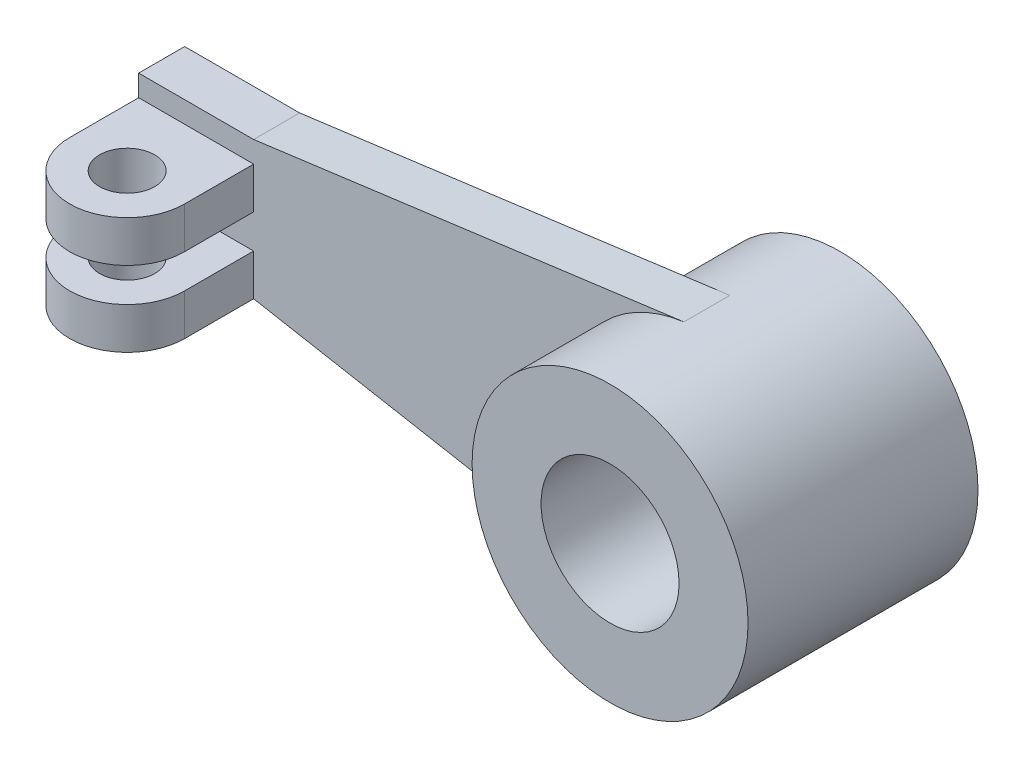
ISO-10303-21;
HEADER;
FILE_DESCRIPTION(('STEP AP214'),'2;1');
FILE_NAME('part.step','',(''),(''),'','','');
FILE_SCHEMA(('AUTOMOTIVE_DESIGN { 1 0 10303 214 1 1 1 1 }'));
ENDSEC;
DATA;
#1=APPLICATION_CONTEXT('core data for automotive mechanical design processes');
#2=APPLICATION_PROTOCOL_DEFINITION('international standard','automotive_design',2000,#1);
#3=PRODUCT_CONTEXT('',#1,'mechanical');
#4=PRODUCT('Part','Part','',(#3));
#5=PRODUCT_RELATED_PRODUCT_CATEGORY('part','',(#4));
#6=PRODUCT_DEFINITION_FORMATION('','',#4);
#7=PRODUCT_DEFINITION_CONTEXT('part definition',#1,'design');
#8=PRODUCT_DEFINITION('design','',#6,#7);
#9=PRODUCT_DEFINITION_SHAPE('','',#8);
#10=(LENGTH_UNIT() NAMED_UNIT(*) SI_UNIT(.MILLI.,.METRE.));
#11=(NAMED_UNIT(*) PLANE_ANGLE_UNIT() SI_UNIT($,.RADIAN.));
#12=(NAMED_UNIT(*) SI_UNIT($,.STERADIAN.) SOLID_ANGLE_UNIT());
#13=UNCERTAINTY_MEASURE_WITH_UNIT(LENGTH_MEASURE(1.E-05),#10,'distance_accuracy_value','');
#14=(GEOMETRIC_REPRESENTATION_CONTEXT(3) GLOBAL_UNCERTAINTY_ASSIGNED_CONTEXT((#13)) GLOBAL_UNIT_ASSIGNED_CONTEXT((#10,
#11,#12)) REPRESENTATION_CONTEXT('',''));
#15=CARTESIAN_POINT('',(0.,0.,0.));
#16=DIRECTION('',(0.,0.,1.));
#17=DIRECTION('',(1.,0.,0.));
#18=AXIS2_PLACEMENT_3D('',#15,#16,#17);
#19=CARTESIAN_POINT('',(0.,0.,25.));
#20=DIRECTION('',(0.,0.,1.));
#21=DIRECTION('',(1.,0.,0.));
#22=AXIS2_PLACEMENT_3D('',#19,#20,#21);
#23=PLANE('',#22);
#24=CARTESIAN_POINT('',(0.,0.,25.));
#25=DIRECTION('',(0.,0.,1.));
#26=DIRECTION('',(1.,0.,0.));
#27=AXIS2_PLACEMENT_3D('',#24,#25,#26);
#28=CIRCLE('',#27,30.);
#29=CARTESIAN_POINT('',(30.,0.,25.));
#30=VERTEX_POINT('',#29);
#31=EDGE_CURVE('E11',#30,#30,#28,.T.);
#32=ORIENTED_EDGE('',*,*,#31,.T.);
#33=EDGE_LOOP('',(#32));
#34=FACE_BOUND('',#33,.T.);
#35=CARTESIAN_POINT('',(0.,0.,25.));
#36=DIRECTION('',(0.,0.,1.));
#37=DIRECTION('',(1.,0.,0.));
#38=AXIS2_PLACEMENT_3D('',#35,#36,#37);
#39=CIRCLE('',#38,15.);
#40=CARTESIAN_POINT('',(15.,0.,25.));
#41=VERTEX_POINT('',#40);
#42=EDGE_CURVE('E241',#41,#41,#39,.T.);
#43=ORIENTED_EDGE('',*,*,#42,.F.);
#44=EDGE_LOOP('',(#43));
#45=FACE_BOUND('',#44,.T.);
#46=ADVANCED_FACE('F33',(#34,#45),#23,.T.);
#47=CARTESIAN_POINT('',(0.,0.,-25.));
#48=DIRECTION('',(0.,0.,1.));
#49=DIRECTION('',(1.,0.,0.));
#50=AXIS2_PLACEMENT_3D('',#47,#48,#49);
#51=PLANE('',#50);
#52=CARTESIAN_POINT('',(0.,0.,-25.));
#53=DIRECTION('',(0.,0.,1.));
#54=DIRECTION('',(1.,0.,0.));
#55=AXIS2_PLACEMENT_3D('',#52,#53,#54);
#56=CIRCLE('',#55,30.);
#57=CARTESIAN_POINT('',(30.,0.,-25.));
#58=VERTEX_POINT('',#57);
#59=EDGE_CURVE('E37',#58,#58,#56,.T.);
#60=ORIENTED_EDGE('',*,*,#59,.F.);
#61=EDGE_LOOP('',(#60));
#62=FACE_BOUND('',#61,.T.);
#63=CARTESIAN_POINT('',(0.,0.,-25.));
#64=DIRECTION('',(0.,0.,1.));
#65=DIRECTION('',(1.,0.,0.));
#66=AXIS2_PLACEMENT_3D('',#63,#64,#65);
#67=CIRCLE('',#66,15.);
#68=CARTESIAN_POINT('',(15.,0.,-25.));
#69=VERTEX_POINT('',#68);
#70=EDGE_CURVE('E240',#69,#69,#67,.T.);
#71=ORIENTED_EDGE('',*,*,#70,.T.);
#72=EDGE_LOOP('',(#71));
#73=FACE_BOUND('',#72,.T.);
#74=ADVANCED_FACE('F247',(#62,#73),#51,.F.);
#75=CARTESIAN_POINT('',(0.,0.,25.));
#76=DIRECTION('',(0.,0.,-1.));
#77=DIRECTION('',(-1.,0.,0.));
#78=AXIS2_PLACEMENT_3D('',#75,#76,#77);
#79=CYLINDRICAL_SURFACE('',#78,30.);
#80=DIRECTION('',(0.,0.,-1.));
#81=VECTOR('',#80,1.);
#82=CARTESIAN_POINT('',(-3.94864469314788,29.7390014137542,5.));
#83=LINE('',#82,#81);
#84=CARTESIAN_POINT('',(-3.94864469314787,29.7390014137542,5.));
#85=VERTEX_POINT('',#84);
#86=CARTESIAN_POINT('',(-3.94864469314788,29.7390014137542,-5.));
#87=VERTEX_POINT('',#86);
#88=EDGE_CURVE('E237',#85,#87,#83,.T.);
#89=ORIENTED_EDGE('',*,*,#88,.F.);
#90=CARTESIAN_POINT('',(0.,0.,5.));
#91=DIRECTION('',(0.,0.,-1.));
#92=DIRECTION('',(1.,0.,0.));
#93=AXIS2_PLACEMENT_3D('',#90,#91,#92);
#94=CIRCLE('',#93,30.);
#95=CARTESIAN_POINT('',(-5.39203009891174,-29.5114555963007,5.));
#96=VERTEX_POINT('',#95);
#97=EDGE_CURVE('E198',#96,#85,#94,.T.);
#98=ORIENTED_EDGE('',*,*,#97,.F.);
#99=DIRECTION('',(0.,0.,-1.));
#100=VECTOR('',#99,1.);
#101=CARTESIAN_POINT('',(-5.39203009891174,-29.5114555963007,5.));
#102=LINE('',#101,#100);
#103=CARTESIAN_POINT('',(-5.39203009891174,-29.5114555963007,-5.));
#104=VERTEX_POINT('',#103);
#105=EDGE_CURVE('E212',#96,#104,#102,.T.);
#106=ORIENTED_EDGE('',*,*,#105,.T.);
#107=CARTESIAN_POINT('',(0.,0.,-5.));
#108=DIRECTION('',(0.,0.,-1.));
#109=DIRECTION('',(1.,0.,0.));
#110=AXIS2_PLACEMENT_3D('',#107,#108,#109);
#111=CIRCLE('',#110,30.);
#112=EDGE_CURVE('E194',#104,#87,#111,.T.);
#113=ORIENTED_EDGE('',*,*,#112,.T.);
#114=EDGE_LOOP('',(#89,#98,#106,#113));
#115=FACE_BOUND('',#114,.T.);
#116=ORIENTED_EDGE('',*,*,#31,.F.);
#117=EDGE_LOOP('',(#116));
#118=FACE_BOUND('',#117,.T.);
#119=ORIENTED_EDGE('',*,*,#59,.T.);
#120=EDGE_LOOP('',(#119));
#121=FACE_BOUND('',#120,.T.);
#122=ADVANCED_FACE('F35',(#115,#118,#121),#79,.T.);
#123=CARTESIAN_POINT('',(0.,0.,25.));
#124=DIRECTION('',(0.,0.,-1.));
#125=DIRECTION('',(-1.,0.,0.));
#126=AXIS2_PLACEMENT_3D('',#123,#124,#125);
#127=CYLINDRICAL_SURFACE('',#126,15.);
#128=ORIENTED_EDGE('',*,*,#42,.T.);
#129=EDGE_LOOP('',(#128));
#130=FACE_BOUND('',#129,.T.);
#131=ORIENTED_EDGE('',*,*,#70,.F.);
#132=EDGE_LOOP('',(#131));
#133=FACE_BOUND('',#132,.T.);
#134=ADVANCED_FACE('F249',(#130,#133),#127,.F.);
#135=CARTESIAN_POINT('',(-3.94864469314788,29.7390014137542,5.));
#136=DIRECTION('',(0.131621489771596,-0.99130004712514,0.));
#137=DIRECTION('',(0.991300047125141,0.131621489771596,0.));
#138=AXIS2_PLACEMENT_3D('',#135,#136,#137);
#139=PLANE('',#138);
#140=DIRECTION('',(-0.991300047125141,-0.131621489771596,0.));
#141=VECTOR('',#140,1.);
#142=CARTESIAN_POINT('',(-3.94864469314788,29.7390014137542,-5.));
#143=LINE('',#142,#141);
#144=CARTESIAN_POINT('',(-97.5,17.3175667620061,-5.));
#145=VERTEX_POINT('',#144);
#146=EDGE_CURVE('E214',#87,#145,#143,.T.);
#147=ORIENTED_EDGE('',*,*,#146,.T.);
#148=DIRECTION('',(0.,0.,-1.));
#149=VECTOR('',#148,1.);
#150=CARTESIAN_POINT('',(-97.5,17.3175667620061,5.));
#151=LINE('',#150,#149);
#152=CARTESIAN_POINT('',(-97.5,17.3175667620061,5.));
#153=VERTEX_POINT('',#152);
#154=EDGE_CURVE('E234',#153,#145,#151,.T.);
#155=ORIENTED_EDGE('',*,*,#154,.F.);
#156=DIRECTION('',(-0.991300047125141,-0.131621489771596,0.));
#157=VECTOR('',#156,1.);
#158=CARTESIAN_POINT('',(-3.94864469314788,29.7390014137542,5.));
#159=LINE('',#158,#157);
#160=EDGE_CURVE('E201',#85,#153,#159,.T.);
#161=ORIENTED_EDGE('',*,*,#160,.F.);
#162=ORIENTED_EDGE('',*,*,#88,.T.);
#163=EDGE_LOOP('',(#147,#155,#161,#162));
#164=FACE_BOUND('',#163,.T.);
#165=ADVANCED_FACE('F251',(#164),#139,.F.);
#166=CARTESIAN_POINT('',(-97.5,17.3175667620061,5.));
#167=DIRECTION('',(0.,-1.,0.));
#168=DIRECTION('',(0.,0.,-1.));
#169=AXIS2_PLACEMENT_3D('',#166,#167,#168);
#170=PLANE('',#169);
#171=DIRECTION('',(-1.,0.,0.));
#172=VECTOR('',#171,1.);
#173=CARTESIAN_POINT('',(-97.5,17.3175667620061,-5.));
#174=LINE('',#173,#172);
#175=CARTESIAN_POINT('',(-122.5,17.3175667620061,-5.));
#176=VERTEX_POINT('',#175);
#177=EDGE_CURVE('E216',#145,#176,#174,.T.);
#178=ORIENTED_EDGE('',*,*,#177,.T.);
#179=DIRECTION('',(0.,0.,-1.));
#180=VECTOR('',#179,1.);
#181=CARTESIAN_POINT('',(-122.5,17.3175667620061,5.));
#182=LINE('',#181,#180);
#183=CARTESIAN_POINT('',(-122.5,17.3175667620061,5.));
#184=VERTEX_POINT('',#183);
#185=EDGE_CURVE('E231',#184,#176,#182,.T.);
#186=ORIENTED_EDGE('',*,*,#185,.F.);
#187=DIRECTION('',(-1.,0.,0.));
#188=VECTOR('',#187,1.);
#189=CARTESIAN_POINT('',(-97.5,17.3175667620061,5.));
#190=LINE('',#189,#188);
#191=EDGE_CURVE('E204',#153,#184,#190,.T.);
#192=ORIENTED_EDGE('',*,*,#191,.F.);
#193=ORIENTED_EDGE('',*,*,#154,.T.);
#194=EDGE_LOOP('',(#178,#186,#192,#193));
#195=FACE_BOUND('',#194,.T.);
#196=ADVANCED_FACE('F258',(#195),#170,.F.);
#197=CARTESIAN_POINT('',(-122.5,17.3175667620061,5.));
#198=DIRECTION('',(1.,0.,0.));
#199=DIRECTION('',(0.,0.,-1.));
#200=AXIS2_PLACEMENT_3D('',#197,#198,#199);
#201=PLANE('',#200);
#202=DIRECTION('',(0.,-1.,0.));
#203=VECTOR('',#202,1.);
#204=CARTESIAN_POINT('',(-122.5,17.3175667620061,-5.));
#205=LINE('',#204,#203);
#206=CARTESIAN_POINT('',(-122.5,-12.6824332379939,-5.));
#207=VERTEX_POINT('',#206);
#208=EDGE_CURVE('E218',#176,#207,#205,.T.);
#209=ORIENTED_EDGE('',*,*,#208,.T.);
#210=DIRECTION('',(0.,0.,-1.));
#211=VECTOR('',#210,1.);
#212=CARTESIAN_POINT('',(-122.5,-12.6824332379939,5.));
#213=LINE('',#212,#211);
#214=CARTESIAN_POINT('',(-122.5,-12.6824332379939,20.));
#215=VERTEX_POINT('',#214);
#216=EDGE_CURVE('E228',#215,#207,#213,.T.);
#217=ORIENTED_EDGE('',*,*,#216,.F.);
#218=DIRECTION('',(0.,-1.,0.));
#219=VECTOR('',#218,1.);
#220=CARTESIAN_POINT('',(-122.5,-3.68243323799391,20.));
#221=LINE('',#220,#219);
#222=CARTESIAN_POINT('',(-122.5,-3.68243323799391,20.));
#223=VERTEX_POINT('',#222);
#224=EDGE_CURVE('E191',#223,#215,#221,.T.);
#225=ORIENTED_EDGE('',*,*,#224,.F.);
#226=DIRECTION('',(0.,0.,-1.));
#227=VECTOR('',#226,1.);
#228=CARTESIAN_POINT('',(-122.5,-3.68243323799391,20.));
#229=LINE('',#228,#227);
#230=CARTESIAN_POINT('',(-122.5,-3.68243323799391,5.));
#231=VERTEX_POINT('',#230);
#232=EDGE_CURVE('E176',#223,#231,#229,.T.);
#233=ORIENTED_EDGE('',*,*,#232,.T.);
#234=DIRECTION('',(0.,-1.,0.));
#235=VECTOR('',#234,1.);
#236=CARTESIAN_POINT('',(-122.5,17.3175667620061,5.));
#237=LINE('',#236,#235);
#238=CARTESIAN_POINT('',(-122.5,3.68243323799391,5.));
#239=VERTEX_POINT('',#238);
#240=EDGE_CURVE('E149',#239,#231,#237,.T.);
#241=ORIENTED_EDGE('',*,*,#240,.F.);
#242=DIRECTION('',(0.,0.,-1.));
#243=VECTOR('',#242,1.);
#244=CARTESIAN_POINT('',(-122.5,3.68243323799391,20.));
#245=LINE('',#244,#243);
#246=CARTESIAN_POINT('',(-122.5,3.68243323799391,20.));
#247=VERTEX_POINT('',#246);
#248=EDGE_CURVE('E130',#247,#239,#245,.T.);
#249=ORIENTED_EDGE('',*,*,#248,.F.);
#250=DIRECTION('',(0.,1.,0.));
#251=VECTOR('',#250,1.);
#252=CARTESIAN_POINT('',(-122.5,3.68243323799391,20.));
#253=LINE('',#252,#251);
#254=CARTESIAN_POINT('',(-122.5,12.6824332379939,20.));
#255=VERTEX_POINT('',#254);
#256=EDGE_CURVE('E136',#247,#255,#253,.T.);
#257=ORIENTED_EDGE('',*,*,#256,.T.);
#258=DIRECTION('',(0.,0.,-1.));
#259=VECTOR('',#258,1.);
#260=CARTESIAN_POINT('',(-122.5,12.6824332379939,20.));
#261=LINE('',#260,#259);
#262=CARTESIAN_POINT('',(-122.5,12.6824332379939,5.));
#263=VERTEX_POINT('',#262);
#264=EDGE_CURVE('E161',#255,#263,#261,.T.);
#265=ORIENTED_EDGE('',*,*,#264,.T.);
#266=EDGE_CURVE('E206',#184,#263,#237,.T.);
#267=ORIENTED_EDGE('',*,*,#266,.F.);
#268=ORIENTED_EDGE('',*,*,#185,.T.);
#269=EDGE_LOOP('',(#209,#217,#225,#233,#241,#249,#257,#265,#267,#268));
#270=FACE_BOUND('',#269,.T.);
#271=ADVANCED_FACE('F147',(#270),#201,.F.);
#272=CARTESIAN_POINT('',(-122.5,-12.6824332379939,5.));
#273=DIRECTION('',(0.,1.,0.));
#274=DIRECTION('',(0.,0.,1.));
#275=AXIS2_PLACEMENT_3D('',#272,#273,#274);
#276=PLANE('',#275);
#277=DIRECTION('',(1.,0.,0.));
#278=VECTOR('',#277,1.);
#279=CARTESIAN_POINT('',(-122.5,-12.6824332379939,-5.));
#280=LINE('',#279,#278);
#281=CARTESIAN_POINT('',(-97.5,-12.6824332379939,-5.));
#282=VERTEX_POINT('',#281);
#283=EDGE_CURVE('E220',#207,#282,#280,.T.);
#284=ORIENTED_EDGE('',*,*,#283,.T.);
#285=DIRECTION('',(0.,0.,-1.));
#286=VECTOR('',#285,1.);
#287=CARTESIAN_POINT('',(-97.5,-12.6824332379939,5.));
#288=LINE('',#287,#286);
#289=CARTESIAN_POINT('',(-97.5,-12.6824332379939,5.));
#290=VERTEX_POINT('',#289);
#291=EDGE_CURVE('E225',#290,#282,#288,.T.);
#292=ORIENTED_EDGE('',*,*,#291,.F.);
#293=DIRECTION('',(0.,0.,1.));
#294=VECTOR('',#293,1.);
#295=CARTESIAN_POINT('',(-97.5,-12.6824332379939,5.));
#296=LINE('',#295,#294);
#297=CARTESIAN_POINT('',(-97.5,-12.6824332379939,20.));
#298=VERTEX_POINT('',#297);
#299=EDGE_CURVE('E173',#290,#298,#296,.T.);
#300=ORIENTED_EDGE('',*,*,#299,.T.);
#301=CARTESIAN_POINT('',(-110.,-12.6824332379939,20.));
#302=DIRECTION('',(0.,-1.,0.));
#303=DIRECTION('',(0.,0.,1.));
#304=AXIS2_PLACEMENT_3D('',#301,#302,#303);
#305=CIRCLE('',#304,12.5);
#306=EDGE_CURVE('E178',#298,#215,#305,.T.);
#307=ORIENTED_EDGE('',*,*,#306,.T.);
#308=ORIENTED_EDGE('',*,*,#216,.T.);
#309=EDGE_LOOP('',(#284,#292,#300,#307,#308));
#310=FACE_BOUND('',#309,.T.);
#311=CARTESIAN_POINT('',(-110.,-12.6824332379939,20.));
#312=DIRECTION('',(0.,-1.,0.));
#313=DIRECTION('',(0.,0.,-1.));
#314=AXIS2_PLACEMENT_3D('',#311,#312,#313);
#315=CIRCLE('',#314,6.);
#316=CARTESIAN_POINT('',(-110.,-12.6824332379939,14.));
#317=VERTEX_POINT('',#316);
#318=EDGE_CURVE('E168',#317,#317,#315,.T.);
#319=ORIENTED_EDGE('',*,*,#318,.F.);
#320=EDGE_LOOP('',(#319));
#321=FACE_BOUND('',#320,.T.);
#322=ADVANCED_FACE('F312',(#310,#321),#276,.F.);
#323=CARTESIAN_POINT('',(-97.5,-12.6824332379939,5.));
#324=DIRECTION('',(0.179734336630391,0.983715186543358,0.));
#325=DIRECTION('',(-0.983715186543358,0.179734336630391,0.));
#326=AXIS2_PLACEMENT_3D('',#323,#324,#325);
#327=PLANE('',#326);
#328=DIRECTION('',(0.983715186543358,-0.179734336630391,0.));
#329=VECTOR('',#328,1.);
#330=CARTESIAN_POINT('',(-97.5,-12.6824332379939,-5.));
#331=LINE('',#330,#329);
#332=EDGE_CURVE('E202',#282,#104,#331,.T.);
#333=ORIENTED_EDGE('',*,*,#332,.T.);
#334=ORIENTED_EDGE('',*,*,#105,.F.);
#335=DIRECTION('',(0.983715186543358,-0.179734336630391,0.));
#336=VECTOR('',#335,1.);
#337=CARTESIAN_POINT('',(-97.5,-12.6824332379939,5.));
#338=LINE('',#337,#336);
#339=EDGE_CURVE('E209',#290,#96,#338,.T.);
#340=ORIENTED_EDGE('',*,*,#339,.F.);
#341=ORIENTED_EDGE('',*,*,#291,.T.);
#342=EDGE_LOOP('',(#333,#334,#340,#341));
#343=FACE_BOUND('',#342,.T.);
#344=ADVANCED_FACE('F306',(#343),#327,.F.);
#345=CARTESIAN_POINT('',(0.,0.,5.));
#346=DIRECTION('',(0.,0.,1.));
#347=DIRECTION('',(1.,0.,0.));
#348=AXIS2_PLACEMENT_3D('',#345,#346,#347);
#349=PLANE('',#348);
#350=DIRECTION('',(1.,0.,0.));
#351=VECTOR('',#350,1.);
#352=CARTESIAN_POINT('',(-122.5,3.68243323799391,5.));
#353=LINE('',#352,#351);
#354=CARTESIAN_POINT('',(-97.5,3.68243323799391,5.));
#355=VERTEX_POINT('',#354);
#356=EDGE_CURVE('E144',#239,#355,#353,.T.);
#357=ORIENTED_EDGE('',*,*,#356,.F.);
#358=ORIENTED_EDGE('',*,*,#240,.T.);
#359=DIRECTION('',(1.,0.,0.));
#360=VECTOR('',#359,1.);
#361=CARTESIAN_POINT('',(-122.5,-3.68243323799391,5.));
#362=LINE('',#361,#360);
#363=CARTESIAN_POINT('',(-97.5,-3.68243323799391,5.));
#364=VERTEX_POINT('',#363);
#365=EDGE_CURVE('E56',#231,#364,#362,.T.);
#366=ORIENTED_EDGE('',*,*,#365,.T.);
#367=DIRECTION('',(0.,-1.,0.));
#368=VECTOR('',#367,1.);
#369=CARTESIAN_POINT('',(-97.5,-3.68243323799391,5.));
#370=LINE('',#369,#368);
#371=EDGE_CURVE('E186',#364,#290,#370,.T.);
#372=ORIENTED_EDGE('',*,*,#371,.T.);
#373=ORIENTED_EDGE('',*,*,#339,.T.);
#374=ORIENTED_EDGE('',*,*,#97,.T.);
#375=ORIENTED_EDGE('',*,*,#160,.T.);
#376=ORIENTED_EDGE('',*,*,#191,.T.);
#377=ORIENTED_EDGE('',*,*,#266,.T.);
#378=DIRECTION('',(1.,0.,0.));
#379=VECTOR('',#378,1.);
#380=CARTESIAN_POINT('',(-122.5,12.6824332379939,5.));
#381=LINE('',#380,#379);
#382=CARTESIAN_POINT('',(-97.5,12.6824332379939,5.));
#383=VERTEX_POINT('',#382);
#384=EDGE_CURVE('E150',#263,#383,#381,.T.);
#385=ORIENTED_EDGE('',*,*,#384,.T.);
#386=DIRECTION('',(0.,1.,0.));
#387=VECTOR('',#386,1.);
#388=CARTESIAN_POINT('',(-97.5,3.68243323799391,5.));
#389=LINE('',#388,#387);
#390=EDGE_CURVE('E166',#355,#383,#389,.T.);
#391=ORIENTED_EDGE('',*,*,#390,.F.);
#392=EDGE_LOOP('',(#357,#358,#366,#372,#373,#374,#375,#376,#377,#385,#391));
#393=FACE_BOUND('',#392,.T.);
#394=ADVANCED_FACE('F311',(#393),#349,.T.);
#395=CARTESIAN_POINT('',(0.,0.,-5.));
#396=DIRECTION('',(0.,0.,1.));
#397=DIRECTION('',(1.,0.,0.));
#398=AXIS2_PLACEMENT_3D('',#395,#396,#397);
#399=PLANE('',#398);
#400=ORIENTED_EDGE('',*,*,#112,.F.);
#401=ORIENTED_EDGE('',*,*,#332,.F.);
#402=ORIENTED_EDGE('',*,*,#283,.F.);
#403=ORIENTED_EDGE('',*,*,#208,.F.);
#404=ORIENTED_EDGE('',*,*,#177,.F.);
#405=ORIENTED_EDGE('',*,*,#146,.F.);
#406=EDGE_LOOP('',(#400,#401,#402,#403,#404,#405));
#407=FACE_BOUND('',#406,.T.);
#408=ADVANCED_FACE('F322',(#407),#399,.F.);
#409=CARTESIAN_POINT('',(-110.,-3.68243323799391,20.));
#410=DIRECTION('',(0.,-1.,0.));
#411=DIRECTION('',(0.,0.,-1.));
#412=AXIS2_PLACEMENT_3D('',#409,#410,#411);
#413=CYLINDRICAL_SURFACE('',#412,12.5);
#414=ORIENTED_EDGE('',*,*,#306,.F.);
#415=DIRECTION('',(0.,-1.,0.));
#416=VECTOR('',#415,1.);
#417=CARTESIAN_POINT('',(-97.5,-3.68243323799391,20.));
#418=LINE('',#417,#416);
#419=CARTESIAN_POINT('',(-97.5,-3.68243323799391,20.));
#420=VERTEX_POINT('',#419);
#421=EDGE_CURVE('E195',#420,#298,#418,.T.);
#422=ORIENTED_EDGE('',*,*,#421,.F.);
#423=CARTESIAN_POINT('',(-110.,-3.68243323799391,20.));
#424=DIRECTION('',(0.,-1.,0.));
#425=DIRECTION('',(0.,0.,1.));
#426=AXIS2_PLACEMENT_3D('',#423,#424,#425);
#427=CIRCLE('',#426,12.5);
#428=EDGE_CURVE('E183',#420,#223,#427,.T.);
#429=ORIENTED_EDGE('',*,*,#428,.T.);
#430=ORIENTED_EDGE('',*,*,#224,.T.);
#431=EDGE_LOOP('',(#414,#422,#429,#430));
#432=FACE_BOUND('',#431,.T.);
#433=ADVANCED_FACE('F327',(#432),#413,.T.);
#434=CARTESIAN_POINT('',(-97.5,-3.68243323799391,5.));
#435=DIRECTION('',(1.,0.,0.));
#436=DIRECTION('',(0.,0.,-1.));
#437=AXIS2_PLACEMENT_3D('',#434,#435,#436);
#438=PLANE('',#437);
#439=ORIENTED_EDGE('',*,*,#299,.F.);
#440=ORIENTED_EDGE('',*,*,#371,.F.);
#441=DIRECTION('',(0.,0.,1.));
#442=VECTOR('',#441,1.);
#443=CARTESIAN_POINT('',(-97.5,-3.68243323799391,5.));
#444=LINE('',#443,#442);
#445=EDGE_CURVE('E180',#364,#420,#444,.T.);
#446=ORIENTED_EDGE('',*,*,#445,.T.);
#447=ORIENTED_EDGE('',*,*,#421,.T.);
#448=EDGE_LOOP('',(#439,#440,#446,#447));
#449=FACE_BOUND('',#448,.T.);
#450=ADVANCED_FACE('F346',(#449),#438,.T.);
#451=CARTESIAN_POINT('',(-110.,-3.68243323799391,20.));
#452=DIRECTION('',(0.,1.,0.));
#453=DIRECTION('',(0.,0.,1.));
#454=AXIS2_PLACEMENT_3D('',#451,#452,#453);
#455=PLANE('',#454);
#456=CARTESIAN_POINT('',(-110.,-3.68243323799391,20.));
#457=DIRECTION('',(0.,-1.,0.));
#458=DIRECTION('',(0.,0.,-1.));
#459=AXIS2_PLACEMENT_3D('',#456,#457,#458);
#460=CIRCLE('',#459,6.);
#461=CARTESIAN_POINT('',(-110.,-3.68243323799391,14.));
#462=VERTEX_POINT('',#461);
#463=EDGE_CURVE('E170',#462,#462,#460,.T.);
#464=ORIENTED_EDGE('',*,*,#463,.T.);
#465=EDGE_LOOP('',(#464));
#466=FACE_BOUND('',#465,.T.);
#467=ORIENTED_EDGE('',*,*,#232,.F.);
#468=ORIENTED_EDGE('',*,*,#428,.F.);
#469=ORIENTED_EDGE('',*,*,#445,.F.);
#470=ORIENTED_EDGE('',*,*,#365,.F.);
#471=EDGE_LOOP('',(#467,#468,#469,#470));
#472=FACE_BOUND('',#471,.T.);
#473=ADVANCED_FACE('F356',(#466,#472),#455,.T.);
#474=CARTESIAN_POINT('',(-110.,-3.68243323799391,20.));
#475=DIRECTION('',(0.,-1.,0.));
#476=DIRECTION('',(0.,0.,-1.));
#477=AXIS2_PLACEMENT_3D('',#474,#475,#476);
#478=CYLINDRICAL_SURFACE('',#477,6.);
#479=ORIENTED_EDGE('',*,*,#463,.F.);
#480=EDGE_LOOP('',(#479));
#481=FACE_BOUND('',#480,.T.);
#482=ORIENTED_EDGE('',*,*,#318,.T.);
#483=EDGE_LOOP('',(#482));
#484=FACE_BOUND('',#483,.T.);
#485=ADVANCED_FACE('F366',(#481,#484),#478,.F.);
#486=CARTESIAN_POINT('',(-110.,3.68243323799391,20.));
#487=DIRECTION('',(0.,-1.,0.));
#488=DIRECTION('',(0.,0.,1.));
#489=AXIS2_PLACEMENT_3D('',#486,#487,#488);
#490=PLANE('',#489);
#491=ORIENTED_EDGE('',*,*,#248,.T.);
#492=ORIENTED_EDGE('',*,*,#356,.T.);
#493=DIRECTION('',(0.,0.,1.));
#494=VECTOR('',#493,1.);
#495=CARTESIAN_POINT('',(-97.5,3.68243323799391,5.));
#496=LINE('',#495,#494);
#497=CARTESIAN_POINT('',(-97.5,3.68243323799391,20.));
#498=VERTEX_POINT('',#497);
#499=EDGE_CURVE('E48',#355,#498,#496,.T.);
#500=ORIENTED_EDGE('',*,*,#499,.T.);
#501=CARTESIAN_POINT('',(-110.,3.68243323799391,20.));
#502=DIRECTION('',(0.,-1.,0.));
#503=DIRECTION('',(0.,0.,1.));
#504=AXIS2_PLACEMENT_3D('',#501,#502,#503);
#505=CIRCLE('',#504,12.5);
#506=EDGE_CURVE('E125',#498,#247,#505,.T.);
#507=ORIENTED_EDGE('',*,*,#506,.T.);
#508=EDGE_LOOP('',(#491,#492,#500,#507));
#509=FACE_BOUND('',#508,.T.);
#510=CARTESIAN_POINT('',(-110.,3.68243323799391,20.));
#511=DIRECTION('',(0.,-1.,0.));
#512=DIRECTION('',(0.,0.,-1.));
#513=AXIS2_PLACEMENT_3D('',#510,#511,#512);
#514=CIRCLE('',#513,6.);
#515=CARTESIAN_POINT('',(-110.,3.68243323799391,14.));
#516=VERTEX_POINT('',#515);
#517=EDGE_CURVE('E163',#516,#516,#514,.T.);
#518=ORIENTED_EDGE('',*,*,#517,.F.);
#519=EDGE_LOOP('',(#518));
#520=FACE_BOUND('',#519,.T.);
#521=ADVANCED_FACE('F127',(#509,#520),#490,.T.);
#522=CARTESIAN_POINT('',(-110.,12.6824332379939,20.));
#523=DIRECTION('',(0.,-1.,0.));
#524=DIRECTION('',(0.,0.,1.));
#525=AXIS2_PLACEMENT_3D('',#522,#523,#524);
#526=PLANE('',#525);
#527=ORIENTED_EDGE('',*,*,#264,.F.);
#528=CARTESIAN_POINT('',(-110.,12.6824332379939,20.));
#529=DIRECTION('',(0.,-1.,0.));
#530=DIRECTION('',(0.,0.,1.));
#531=AXIS2_PLACEMENT_3D('',#528,#529,#530);
#532=CIRCLE('',#531,12.5);
#533=CARTESIAN_POINT('',(-97.5,12.6824332379939,20.));
#534=VERTEX_POINT('',#533);
#535=EDGE_CURVE('E139',#534,#255,#532,.T.);
#536=ORIENTED_EDGE('',*,*,#535,.F.);
#537=DIRECTION('',(0.,0.,1.));
#538=VECTOR('',#537,1.);
#539=CARTESIAN_POINT('',(-97.5,12.6824332379939,5.));
#540=LINE('',#539,#538);
#541=EDGE_CURVE('E153',#383,#534,#540,.T.);
#542=ORIENTED_EDGE('',*,*,#541,.F.);
#543=ORIENTED_EDGE('',*,*,#384,.F.);
#544=EDGE_LOOP('',(#527,#536,#542,#543));
#545=FACE_BOUND('',#544,.T.);
#546=CARTESIAN_POINT('',(-110.,12.6824332379939,20.));
#547=DIRECTION('',(0.,-1.,0.));
#548=DIRECTION('',(0.,0.,-1.));
#549=AXIS2_PLACEMENT_3D('',#546,#547,#548);
#550=CIRCLE('',#549,6.);
#551=CARTESIAN_POINT('',(-110.,12.6824332379939,14.));
#552=VERTEX_POINT('',#551);
#553=EDGE_CURVE('E156',#552,#552,#550,.T.);
#554=ORIENTED_EDGE('',*,*,#553,.T.);
#555=EDGE_LOOP('',(#554));
#556=FACE_BOUND('',#555,.T.);
#557=ADVANCED_FACE('F398',(#545,#556),#526,.F.);
#558=CARTESIAN_POINT('',(-97.5,3.68243323799391,5.));
#559=DIRECTION('',(-1.,0.,0.));
#560=DIRECTION('',(0.,0.,1.));
#561=AXIS2_PLACEMENT_3D('',#558,#559,#560);
#562=PLANE('',#561);
#563=ORIENTED_EDGE('',*,*,#541,.T.);
#564=DIRECTION('',(0.,1.,0.));
#565=VECTOR('',#564,1.);
#566=CARTESIAN_POINT('',(-97.5,3.68243323799391,20.));
#567=LINE('',#566,#565);
#568=EDGE_CURVE('E143',#498,#534,#567,.T.);
#569=ORIENTED_EDGE('',*,*,#568,.F.);
#570=ORIENTED_EDGE('',*,*,#499,.F.);
#571=ORIENTED_EDGE('',*,*,#390,.T.);
#572=EDGE_LOOP('',(#563,#569,#570,#571));
#573=FACE_BOUND('',#572,.T.);
#574=ADVANCED_FACE('F407',(#573),#562,.F.);
#575=CARTESIAN_POINT('',(-110.,3.68243323799391,20.));
#576=DIRECTION('',(0.,1.,0.));
#577=DIRECTION('',(0.,0.,1.));
#578=AXIS2_PLACEMENT_3D('',#575,#576,#577);
#579=CYLINDRICAL_SURFACE('',#578,12.5);
#580=ORIENTED_EDGE('',*,*,#535,.T.);
#581=ORIENTED_EDGE('',*,*,#256,.F.);
#582=ORIENTED_EDGE('',*,*,#506,.F.);
#583=ORIENTED_EDGE('',*,*,#568,.T.);
#584=EDGE_LOOP('',(#580,#581,#582,#583));
#585=FACE_BOUND('',#584,.T.);
#586=ADVANCED_FACE('F137',(#585),#579,.T.);
#587=CARTESIAN_POINT('',(-110.,3.68243323799391,20.));
#588=DIRECTION('',(0.,1.,0.));
#589=DIRECTION('',(0.,0.,1.));
#590=AXIS2_PLACEMENT_3D('',#587,#588,#589);
#591=CYLINDRICAL_SURFACE('',#590,6.);
#592=ORIENTED_EDGE('',*,*,#517,.T.);
#593=EDGE_LOOP('',(#592));
#594=FACE_BOUND('',#593,.T.);
#595=ORIENTED_EDGE('',*,*,#553,.F.);
#596=EDGE_LOOP('',(#595));
#597=FACE_BOUND('',#596,.T.);
#598=ADVANCED_FACE('F425',(#594,#597),#591,.F.);
#599=CLOSED_SHELL('',(#46,#74,#122,#134,#165,#196,#271,#322,#344,#394,#408,#433,#450,#473,#485,
#521,#557,#574,#586,#598));
#600=MANIFOLD_SOLID_BREP('B2',#599);
#601=ADVANCED_BREP_SHAPE_REPRESENTATION('',(#18,#600),#14);
#602=SHAPE_DEFINITION_REPRESENTATION(#9,#601);
ENDSEC;
END-ISO-10303-21;
